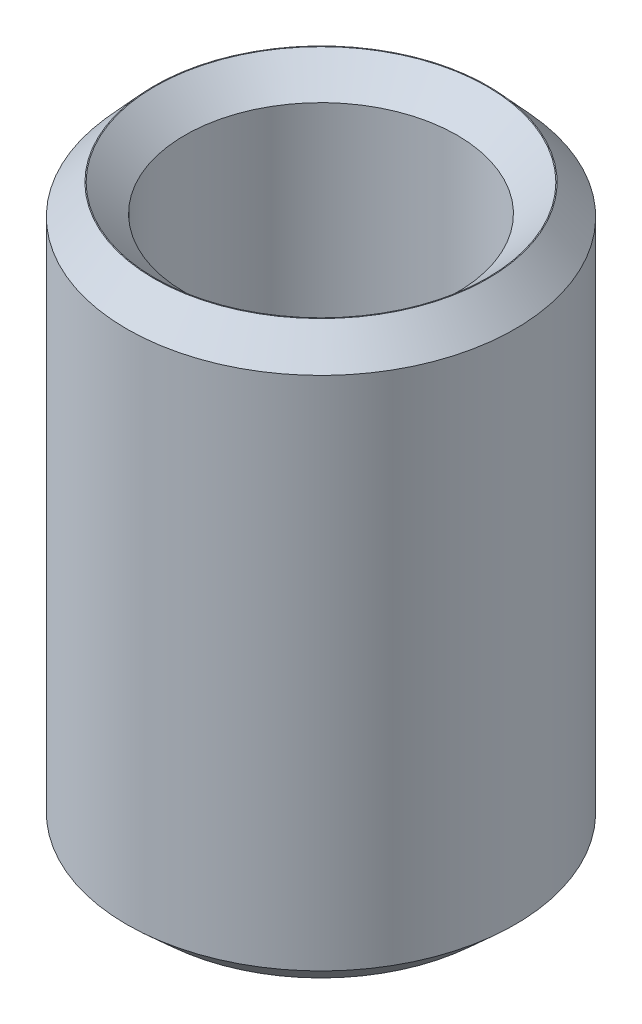
ISO-10303-21;
HEADER;
FILE_DESCRIPTION(('STEP AP214'),'2;1');
FILE_NAME('part.step','',(''),(''),'','','');
FILE_SCHEMA(('AUTOMOTIVE_DESIGN { 1 0 10303 214 1 1 1 1 }'));
ENDSEC;
DATA;
#1=APPLICATION_CONTEXT('core data for automotive mechanical design processes');
#2=APPLICATION_PROTOCOL_DEFINITION('international standard','automotive_design',2000,#1);
#3=PRODUCT_CONTEXT('',#1,'mechanical');
#4=PRODUCT('Part','Part','',(#3));
#5=PRODUCT_RELATED_PRODUCT_CATEGORY('part','',(#4));
#6=PRODUCT_DEFINITION_FORMATION('','',#4);
#7=PRODUCT_DEFINITION_CONTEXT('part definition',#1,'design');
#8=PRODUCT_DEFINITION('design','',#6,#7);
#9=PRODUCT_DEFINITION_SHAPE('','',#8);
#10=(LENGTH_UNIT() NAMED_UNIT(*) SI_UNIT(.MILLI.,.METRE.));
#11=(NAMED_UNIT(*) PLANE_ANGLE_UNIT() SI_UNIT($,.RADIAN.));
#12=(NAMED_UNIT(*) SI_UNIT($,.STERADIAN.) SOLID_ANGLE_UNIT());
#13=UNCERTAINTY_MEASURE_WITH_UNIT(LENGTH_MEASURE(1.E-05),#10,'distance_accuracy_value','');
#14=(GEOMETRIC_REPRESENTATION_CONTEXT(3) GLOBAL_UNCERTAINTY_ASSIGNED_CONTEXT((#13)) GLOBAL_UNIT_ASSIGNED_CONTEXT((#10,
#11,#12)) REPRESENTATION_CONTEXT('',''));
#15=CARTESIAN_POINT('',(0.,0.,0.));
#16=DIRECTION('',(0.,0.,1.));
#17=DIRECTION('',(1.,0.,0.));
#18=AXIS2_PLACEMENT_3D('',#15,#16,#17);
#19=CARTESIAN_POINT('',(0.,66.3759837890116,0.));
#20=DIRECTION('',(0.,-1.,0.));
#21=DIRECTION('',(0.,0.,-1.));
#22=AXIS2_PLACEMENT_3D('',#19,#20,#21);
#23=CYLINDRICAL_SURFACE('',#22,22.5);
#24=CARTESIAN_POINT('',(0.,3.15964770142467,0.));
#25=DIRECTION('',(0.,1.,0.));
#26=DIRECTION('',(0.,0.,1.));
#27=AXIS2_PLACEMENT_3D('',#24,#25,#26);
#28=CIRCLE('',#27,22.5);
#29=CARTESIAN_POINT('',(0.,3.15964770142467,22.5));
#30=VERTEX_POINT('',#29);
#31=EDGE_CURVE('E10',#30,#30,#28,.T.);
#32=ORIENTED_EDGE('',*,*,#31,.T.);
#33=EDGE_LOOP('',(#32));
#34=FACE_BOUND('',#33,.T.);
#35=CARTESIAN_POINT('',(0.,62.9045818362164,0.));
#36=DIRECTION('',(0.,1.,0.));
#37=DIRECTION('',(0.,0.,1.));
#38=AXIS2_PLACEMENT_3D('',#35,#36,#37);
#39=CIRCLE('',#38,22.5);
#40=CARTESIAN_POINT('',(0.,62.9045818362164,22.5));
#41=VERTEX_POINT('',#40);
#42=EDGE_CURVE('E50',#41,#41,#39,.F.);
#43=ORIENTED_EDGE('',*,*,#42,.T.);
#44=EDGE_LOOP('',(#43));
#45=FACE_BOUND('',#44,.T.);
#46=ADVANCED_FACE('F39',(#34,#45),#23,.T.);
#47=CARTESIAN_POINT('',(0.,66.3759837890116,0.));
#48=DIRECTION('',(0.,1.,0.));
#49=DIRECTION('',(0.,0.,1.));
#50=AXIS2_PLACEMENT_3D('',#47,#48,#49);
#51=PLANE('',#50);
#52=CARTESIAN_POINT('',(0.,66.3759837890116,0.));
#53=DIRECTION('',(0.,1.,0.));
#54=DIRECTION('',(0.,0.,1.));
#55=AXIS2_PLACEMENT_3D('',#52,#53,#54);
#56=CIRCLE('',#55,19.2387489285856);
#57=CARTESIAN_POINT('',(0.,66.3759837890116,19.2387489285856));
#58=VERTEX_POINT('',#57);
#59=EDGE_CURVE('E58',#58,#58,#56,.F.);
#60=ORIENTED_EDGE('',*,*,#59,.T.);
#61=EDGE_LOOP('',(#60));
#62=FACE_BOUND('',#61,.T.);
#63=CARTESIAN_POINT('',(0.,66.3759837890116,0.));
#64=DIRECTION('',(0.,1.,0.));
#65=DIRECTION('',(0.,0.,1.));
#66=AXIS2_PLACEMENT_3D('',#63,#64,#65);
#67=CIRCLE('',#66,19.3403522985753);
#68=CARTESIAN_POINT('',(0.,66.3759837890116,19.3403522985753));
#69=VERTEX_POINT('',#68);
#70=EDGE_CURVE('E61',#69,#69,#67,.T.);
#71=ORIENTED_EDGE('',*,*,#70,.T.);
#72=EDGE_LOOP('',(#71));
#73=FACE_BOUND('',#72,.T.);
#74=ADVANCED_FACE('F88',(#62,#73),#51,.T.);
#75=CARTESIAN_POINT('',(0.,0.,0.));
#76=DIRECTION('',(0.,1.,0.));
#77=DIRECTION('',(0.,0.,1.));
#78=AXIS2_PLACEMENT_3D('',#75,#76,#77);
#79=PLANE('',#78);
#80=CARTESIAN_POINT('',(0.,0.,0.));
#81=DIRECTION('',(0.,1.,0.));
#82=DIRECTION('',(0.,0.,1.));
#83=AXIS2_PLACEMENT_3D('',#80,#81,#82);
#84=CIRCLE('',#83,18.9269946772152);
#85=CARTESIAN_POINT('',(0.,0.,18.9269946772152));
#86=VERTEX_POINT('',#85);
#87=EDGE_CURVE('E51',#86,#86,#84,.T.);
#88=ORIENTED_EDGE('',*,*,#87,.T.);
#89=EDGE_LOOP('',(#88));
#90=FACE_BOUND('',#89,.T.);
#91=CARTESIAN_POINT('',(0.,0.,0.));
#92=DIRECTION('',(0.,1.,0.));
#93=DIRECTION('',(0.,0.,1.));
#94=AXIS2_PLACEMENT_3D('',#91,#92,#93);
#95=CIRCLE('',#94,19.0285980472049);
#96=CARTESIAN_POINT('',(0.,0.,19.0285980472049));
#97=VERTEX_POINT('',#96);
#98=EDGE_CURVE('E54',#97,#97,#95,.F.);
#99=ORIENTED_EDGE('',*,*,#98,.T.);
#100=EDGE_LOOP('',(#99));
#101=FACE_BOUND('',#100,.T.);
#102=ADVANCED_FACE('F83',(#90,#101),#79,.F.);
#103=CARTESIAN_POINT('',(0.,66.3759837890116,0.));
#104=DIRECTION('',(0.,-1.,0.));
#105=DIRECTION('',(0.,0.,-1.));
#106=AXIS2_PLACEMENT_3D('',#103,#104,#105);
#107=CYLINDRICAL_SURFACE('',#106,15.7673469757905);
#108=CARTESIAN_POINT('',(0.,63.2163360875869,0.));
#109=DIRECTION('',(0.,1.,0.));
#110=DIRECTION('',(0.,0.,1.));
#111=AXIS2_PLACEMENT_3D('',#108,#109,#110);
#112=CIRCLE('',#111,15.7673469757905);
#113=CARTESIAN_POINT('',(0.,63.2163360875869,15.7673469757905));
#114=VERTEX_POINT('',#113);
#115=EDGE_CURVE('E67',#114,#114,#112,.T.);
#116=ORIENTED_EDGE('',*,*,#115,.T.);
#117=EDGE_LOOP('',(#116));
#118=FACE_BOUND('',#117,.T.);
#119=CARTESIAN_POINT('',(0.,3.47140195279512,0.));
#120=DIRECTION('',(0.,1.,0.));
#121=DIRECTION('',(0.,0.,1.));
#122=AXIS2_PLACEMENT_3D('',#119,#120,#121);
#123=CIRCLE('',#122,15.7673469757905);
#124=CARTESIAN_POINT('',(0.,3.47140195279512,15.7673469757905));
#125=VERTEX_POINT('',#124);
#126=EDGE_CURVE('E69',#125,#125,#123,.F.);
#127=ORIENTED_EDGE('',*,*,#126,.T.);
#128=EDGE_LOOP('',(#127));
#129=FACE_BOUND('',#128,.T.);
#130=ADVANCED_FACE('F71',(#118,#129),#107,.F.);
#131=CARTESIAN_POINT('',(0.,63.2163360875869,0.));
#132=DIRECTION('',(0.,1.,0.));
#133=DIRECTION('',(0.,0.,1.));
#134=AXIS2_PLACEMENT_3D('',#131,#132,#133);
#135=CONICAL_SURFACE('',#134,15.7673469757905,0.832377884084983);
#136=ORIENTED_EDGE('',*,*,#59,.F.);
#137=EDGE_LOOP('',(#136));
#138=FACE_BOUND('',#137,.T.);
#139=ORIENTED_EDGE('',*,*,#115,.F.);
#140=EDGE_LOOP('',(#139));
#141=FACE_BOUND('',#140,.T.);
#142=ADVANCED_FACE('F77',(#138,#141),#135,.F.);
#143=CARTESIAN_POINT('',(0.,0.,0.));
#144=DIRECTION('',(0.,-1.,0.));
#145=DIRECTION('',(0.,0.,-1.));
#146=AXIS2_PLACEMENT_3D('',#143,#144,#145);
#147=CONICAL_SURFACE('',#146,18.9269946772152,0.738418442709912);
#148=ORIENTED_EDGE('',*,*,#126,.F.);
#149=EDGE_LOOP('',(#148));
#150=FACE_BOUND('',#149,.T.);
#151=ORIENTED_EDGE('',*,*,#87,.F.);
#152=EDGE_LOOP('',(#151));
#153=FACE_BOUND('',#152,.T.);
#154=ADVANCED_FACE('F73',(#150,#153),#147,.F.);
#155=CARTESIAN_POINT('',(0.,3.15964770142467,0.));
#156=DIRECTION('',(0.,1.,0.));
#157=DIRECTION('',(0.,0.,1.));
#158=AXIS2_PLACEMENT_3D('',#155,#156,#157);
#159=CONICAL_SURFACE('',#158,22.5,0.832377884084984);
#160=ORIENTED_EDGE('',*,*,#98,.F.);
#161=EDGE_LOOP('',(#160));
#162=FACE_BOUND('',#161,.T.);
#163=ORIENTED_EDGE('',*,*,#31,.F.);
#164=EDGE_LOOP('',(#163));
#165=FACE_BOUND('',#164,.T.);
#166=ADVANCED_FACE('F76',(#162,#165),#159,.T.);
#167=CARTESIAN_POINT('',(0.,66.3759837890116,0.));
#168=DIRECTION('',(0.,-1.,0.));
#169=DIRECTION('',(0.,0.,-1.));
#170=AXIS2_PLACEMENT_3D('',#167,#168,#169);
#171=CONICAL_SURFACE('',#170,19.3403522985753,0.738418442709913);
#172=ORIENTED_EDGE('',*,*,#42,.F.);
#173=EDGE_LOOP('',(#172));
#174=FACE_BOUND('',#173,.T.);
#175=ORIENTED_EDGE('',*,*,#70,.F.);
#176=EDGE_LOOP('',(#175));
#177=FACE_BOUND('',#176,.T.);
#178=ADVANCED_FACE('F45',(#174,#177),#171,.T.);
#179=CLOSED_SHELL('',(#46,#74,#102,#130,#142,#154,#166,#178));
#180=MANIFOLD_SOLID_BREP('B2',#179);
#181=ADVANCED_BREP_SHAPE_REPRESENTATION('',(#18,#180),#14);
#182=SHAPE_DEFINITION_REPRESENTATION(#9,#181);
ENDSEC;
END-ISO-10303-21;
